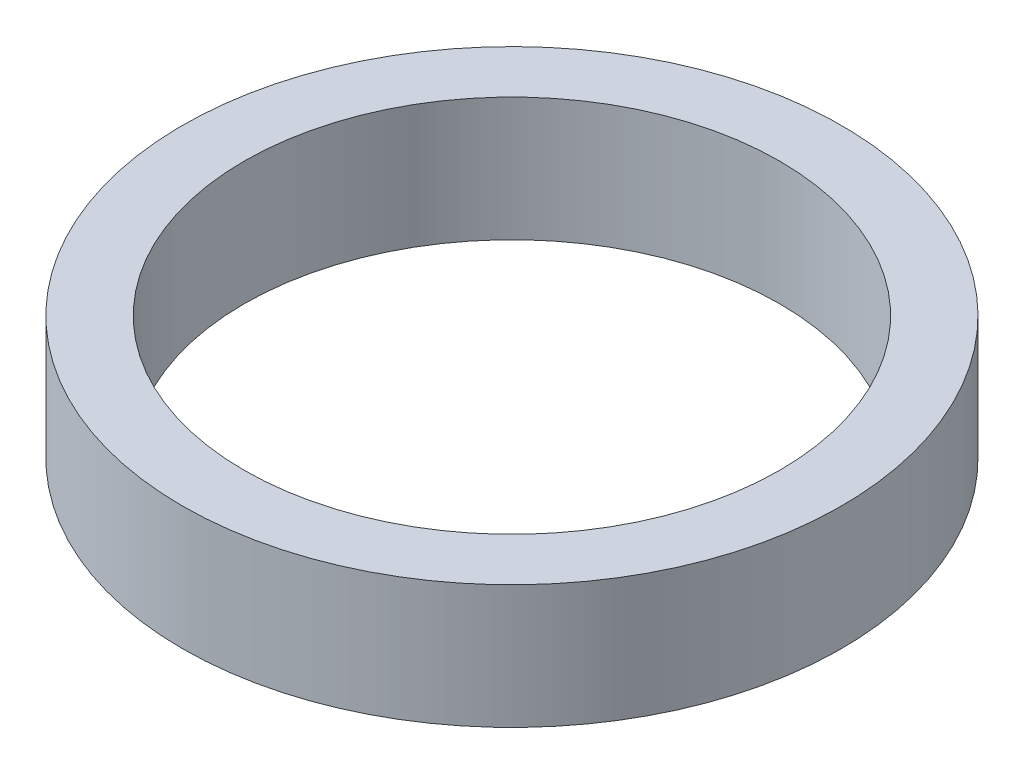
ISO-10303-21;
HEADER;
FILE_DESCRIPTION(('STEP AP214'),'2;1');
FILE_NAME('part.step','',(''),(''),'','','');
FILE_SCHEMA(('AUTOMOTIVE_DESIGN { 1 0 10303 214 1 1 1 1 }'));
ENDSEC;
DATA;
#1=APPLICATION_CONTEXT('core data for automotive mechanical design processes');
#2=APPLICATION_PROTOCOL_DEFINITION('international standard','automotive_design',2000,#1);
#3=PRODUCT_CONTEXT('',#1,'mechanical');
#4=PRODUCT('Part','Part','',(#3));
#5=PRODUCT_RELATED_PRODUCT_CATEGORY('part','',(#4));
#6=PRODUCT_DEFINITION_FORMATION('','',#4);
#7=PRODUCT_DEFINITION_CONTEXT('part definition',#1,'design');
#8=PRODUCT_DEFINITION('design','',#6,#7);
#9=PRODUCT_DEFINITION_SHAPE('','',#8);
#10=(LENGTH_UNIT() NAMED_UNIT(*) SI_UNIT(.MILLI.,.METRE.));
#11=(NAMED_UNIT(*) PLANE_ANGLE_UNIT() SI_UNIT($,.RADIAN.));
#12=(NAMED_UNIT(*) SI_UNIT($,.STERADIAN.) SOLID_ANGLE_UNIT());
#13=UNCERTAINTY_MEASURE_WITH_UNIT(LENGTH_MEASURE(1.E-05),#10,'distance_accuracy_value','');
#14=(GEOMETRIC_REPRESENTATION_CONTEXT(3) GLOBAL_UNCERTAINTY_ASSIGNED_CONTEXT((#13)) GLOBAL_UNIT_ASSIGNED_CONTEXT((#10,
#11,#12)) REPRESENTATION_CONTEXT('',''));
#15=CARTESIAN_POINT('',(0.,0.,0.));
#16=DIRECTION('',(0.,0.,1.));
#17=DIRECTION('',(1.,0.,0.));
#18=AXIS2_PLACEMENT_3D('',#15,#16,#17);
#19=CARTESIAN_POINT('',(0.,3.,0.));
#20=DIRECTION('',(0.,1.,0.));
#21=DIRECTION('',(0.,0.,1.));
#22=AXIS2_PLACEMENT_3D('',#19,#20,#21);
#23=PLANE('',#22);
#24=CARTESIAN_POINT('',(0.,3.,0.));
#25=DIRECTION('',(0.,1.,0.));
#26=DIRECTION('',(0.,0.,1.));
#27=AXIS2_PLACEMENT_3D('',#24,#25,#26);
#28=CIRCLE('',#27,8.00000000000001);
#29=CARTESIAN_POINT('',(0.,3.,8.00000000000001));
#30=VERTEX_POINT('',#29);
#31=EDGE_CURVE('E10',#30,#30,#28,.T.);
#32=ORIENTED_EDGE('',*,*,#31,.T.);
#33=EDGE_LOOP('',(#32));
#34=FACE_BOUND('',#33,.T.);
#35=CARTESIAN_POINT('',(0.,3.,0.));
#36=DIRECTION('',(0.,1.,0.));
#37=DIRECTION('',(0.,0.,1.));
#38=AXIS2_PLACEMENT_3D('',#35,#36,#37);
#39=CIRCLE('',#38,6.5);
#40=CARTESIAN_POINT('',(0.,3.,6.5));
#41=VERTEX_POINT('',#40);
#42=EDGE_CURVE('E42',#41,#41,#39,.T.);
#43=ORIENTED_EDGE('',*,*,#42,.F.);
#44=EDGE_LOOP('',(#43));
#45=FACE_BOUND('',#44,.T.);
#46=ADVANCED_FACE('F31',(#34,#45),#23,.T.);
#47=CARTESIAN_POINT('',(0.,0.,0.));
#48=DIRECTION('',(0.,1.,0.));
#49=DIRECTION('',(0.,0.,1.));
#50=AXIS2_PLACEMENT_3D('',#47,#48,#49);
#51=PLANE('',#50);
#52=CARTESIAN_POINT('',(0.,0.,0.));
#53=DIRECTION('',(0.,1.,0.));
#54=DIRECTION('',(0.,0.,1.));
#55=AXIS2_PLACEMENT_3D('',#52,#53,#54);
#56=CIRCLE('',#55,8.00000000000001);
#57=CARTESIAN_POINT('',(0.,0.,8.00000000000001));
#58=VERTEX_POINT('',#57);
#59=EDGE_CURVE('E35',#58,#58,#56,.T.);
#60=ORIENTED_EDGE('',*,*,#59,.F.);
#61=EDGE_LOOP('',(#60));
#62=FACE_BOUND('',#61,.T.);
#63=CARTESIAN_POINT('',(0.,0.,0.));
#64=DIRECTION('',(0.,1.,0.));
#65=DIRECTION('',(0.,0.,1.));
#66=AXIS2_PLACEMENT_3D('',#63,#64,#65);
#67=CIRCLE('',#66,6.5);
#68=CARTESIAN_POINT('',(0.,0.,6.5));
#69=VERTEX_POINT('',#68);
#70=EDGE_CURVE('E44',#69,#69,#67,.T.);
#71=ORIENTED_EDGE('',*,*,#70,.T.);
#72=EDGE_LOOP('',(#71));
#73=FACE_BOUND('',#72,.T.);
#74=ADVANCED_FACE('F54',(#62,#73),#51,.F.);
#75=CARTESIAN_POINT('',(0.,3.,0.));
#76=DIRECTION('',(0.,-1.,0.));
#77=DIRECTION('',(0.,0.,-1.));
#78=AXIS2_PLACEMENT_3D('',#75,#76,#77);
#79=CYLINDRICAL_SURFACE('',#78,8.00000000000001);
#80=ORIENTED_EDGE('',*,*,#31,.F.);
#81=EDGE_LOOP('',(#80));
#82=FACE_BOUND('',#81,.T.);
#83=ORIENTED_EDGE('',*,*,#59,.T.);
#84=EDGE_LOOP('',(#83));
#85=FACE_BOUND('',#84,.T.);
#86=ADVANCED_FACE('F33',(#82,#85),#79,.T.);
#87=CARTESIAN_POINT('',(0.,3.,0.));
#88=DIRECTION('',(0.,-1.,0.));
#89=DIRECTION('',(0.,0.,-1.));
#90=AXIS2_PLACEMENT_3D('',#87,#88,#89);
#91=CYLINDRICAL_SURFACE('',#90,6.5);
#92=ORIENTED_EDGE('',*,*,#42,.T.);
#93=EDGE_LOOP('',(#92));
#94=FACE_BOUND('',#93,.T.);
#95=ORIENTED_EDGE('',*,*,#70,.F.);
#96=EDGE_LOOP('',(#95));
#97=FACE_BOUND('',#96,.T.);
#98=ADVANCED_FACE('F50',(#94,#97),#91,.F.);
#99=CLOSED_SHELL('',(#46,#74,#86,#98));
#100=MANIFOLD_SOLID_BREP('B2',#99);
#101=ADVANCED_BREP_SHAPE_REPRESENTATION('',(#18,#100),#14);
#102=SHAPE_DEFINITION_REPRESENTATION(#9,#101);
ENDSEC;
END-ISO-10303-21;
